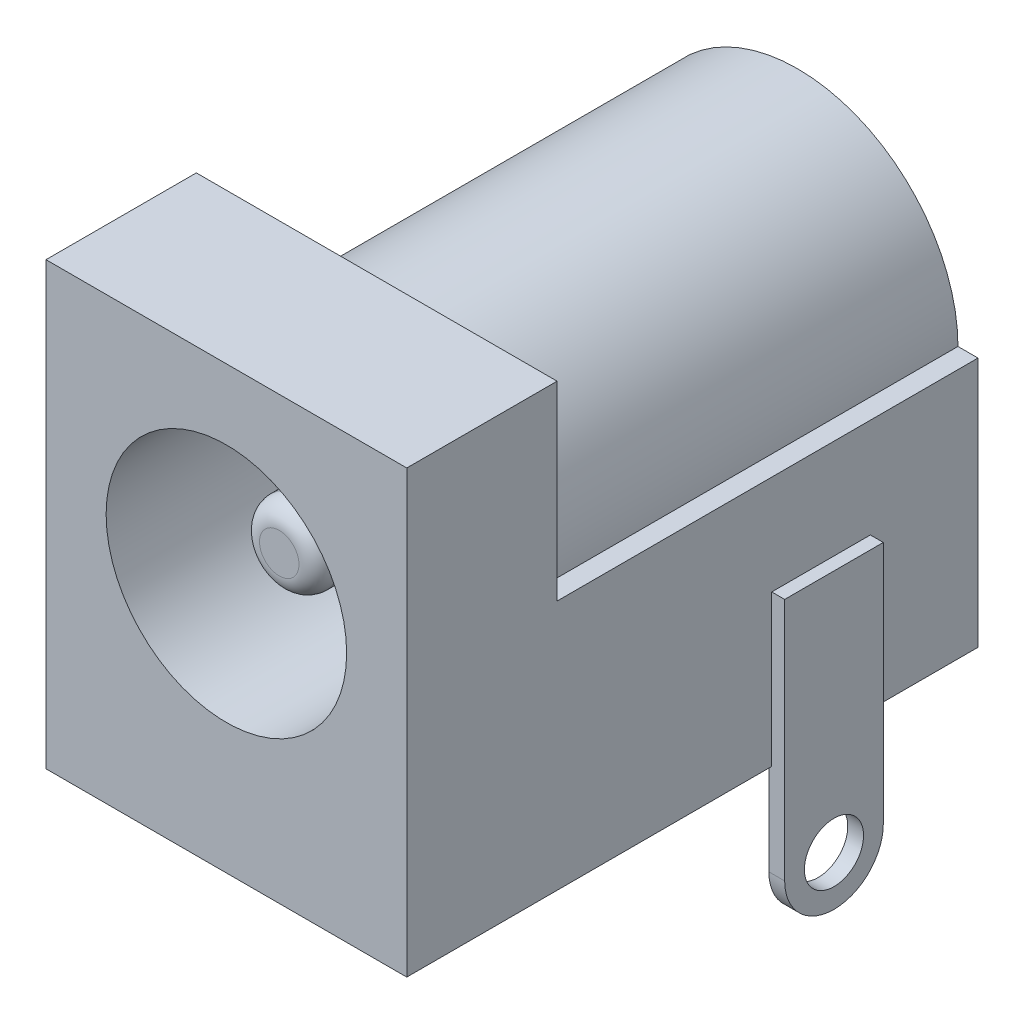
ISO-10303-21;
HEADER;
FILE_DESCRIPTION(('STEP AP214'),'2;1');
FILE_NAME('part.step','',(''),(''),'','','');
FILE_SCHEMA(('AUTOMOTIVE_DESIGN { 1 0 10303 214 1 1 1 1 }'));
ENDSEC;
DATA;
#1=APPLICATION_CONTEXT('core data for automotive mechanical design processes');
#2=APPLICATION_PROTOCOL_DEFINITION('international standard','automotive_design',2000,#1);
#3=PRODUCT_CONTEXT('',#1,'mechanical');
#4=PRODUCT('Part','Part','',(#3));
#5=PRODUCT_RELATED_PRODUCT_CATEGORY('part','',(#4));
#6=PRODUCT_DEFINITION_FORMATION('','',#4);
#7=PRODUCT_DEFINITION_CONTEXT('part definition',#1,'design');
#8=PRODUCT_DEFINITION('design','',#6,#7);
#9=PRODUCT_DEFINITION_SHAPE('','',#8);
#10=(LENGTH_UNIT() NAMED_UNIT(*) SI_UNIT(.MILLI.,.METRE.));
#11=(NAMED_UNIT(*) PLANE_ANGLE_UNIT() SI_UNIT($,.RADIAN.));
#12=(NAMED_UNIT(*) SI_UNIT($,.STERADIAN.) SOLID_ANGLE_UNIT());
#13=UNCERTAINTY_MEASURE_WITH_UNIT(LENGTH_MEASURE(1.E-05),#10,'distance_accuracy_value','');
#14=(GEOMETRIC_REPRESENTATION_CONTEXT(3) GLOBAL_UNCERTAINTY_ASSIGNED_CONTEXT((#13)) GLOBAL_UNIT_ASSIGNED_CONTEXT((#10,
#11,#12)) REPRESENTATION_CONTEXT('',''));
#15=CARTESIAN_POINT('',(0.,0.,0.));
#16=DIRECTION('',(0.,0.,1.));
#17=DIRECTION('',(1.,0.,0.));
#18=AXIS2_PLACEMENT_3D('',#15,#16,#17);
#19=CARTESIAN_POINT('',(-4.572,11.176,-1.34));
#20=DIRECTION('',(0.,0.,-1.));
#21=DIRECTION('',(-1.,0.,0.));
#22=AXIS2_PLACEMENT_3D('',#19,#20,#21);
#23=PLANE('',#22);
#24=CARTESIAN_POINT('',(0.,6.35,-1.34));
#25=DIRECTION('',(0.,0.,-1.));
#26=DIRECTION('',(-1.,0.,0.));
#27=AXIS2_PLACEMENT_3D('',#24,#25,#26);
#28=CIRCLE('',#27,0.499999999999998);
#29=CARTESIAN_POINT('',(-0.499999999999997,6.35,-1.34));
#30=VERTEX_POINT('',#29);
#31=EDGE_CURVE('E240',#30,#30,#28,.F.);
#32=ORIENTED_EDGE('',*,*,#31,.T.);
#33=EDGE_LOOP('',(#32));
#34=FACE_BOUND('',#33,.T.);
#35=ADVANCED_FACE('F17',(#34),#23,.F.);
#36=CARTESIAN_POINT('',(4.9,-2.35000000000015,-10.4999999999999));
#37=DIRECTION('',(-1.,0.,0.));
#38=DIRECTION('',(0.,0.,1.));
#39=AXIS2_PLACEMENT_3D('',#36,#37,#38);
#40=PLANE('',#39);
#41=CARTESIAN_POINT('',(4.9,-2.35000000000015,-10.4999999999999));
#42=DIRECTION('',(-1.,0.,0.));
#43=DIRECTION('',(0.,0.,1.));
#44=AXIS2_PLACEMENT_3D('',#41,#42,#43);
#45=CIRCLE('',#44,0.750000000000001);
#46=CARTESIAN_POINT('',(4.9,-2.35000000000015,-9.7499999999999));
#47=VERTEX_POINT('',#46);
#48=EDGE_CURVE('E173',#47,#47,#45,.T.);
#49=ORIENTED_EDGE('',*,*,#48,.T.);
#50=EDGE_LOOP('',(#49));
#51=FACE_BOUND('',#50,.T.);
#52=DIRECTION('',(0.,1.,0.));
#53=VECTOR('',#52,1.);
#54=CARTESIAN_POINT('',(4.9,3.8299999999999,-9.2499999999999));
#55=LINE('',#54,#53);
#56=CARTESIAN_POINT('',(4.9,3.8299999999999,-9.2499999999999));
#57=VERTEX_POINT('',#56);
#58=CARTESIAN_POINT('',(4.9,-2.35000000000015,-9.2499999999999));
#59=VERTEX_POINT('',#58);
#60=EDGE_CURVE('E169',#57,#59,#55,.F.);
#61=ORIENTED_EDGE('',*,*,#60,.T.);
#62=CARTESIAN_POINT('',(4.9,-2.35000000000015,-10.4999999999999));
#63=DIRECTION('',(-1.,0.,0.));
#64=DIRECTION('',(0.,0.,1.));
#65=AXIS2_PLACEMENT_3D('',#62,#63,#64);
#66=CIRCLE('',#65,1.25);
#67=CARTESIAN_POINT('',(4.9,-2.35000000000015,-11.7499999999999));
#68=VERTEX_POINT('',#67);
#69=EDGE_CURVE('E21',#68,#59,#66,.T.);
#70=ORIENTED_EDGE('',*,*,#69,.F.);
#71=DIRECTION('',(0.,1.,0.));
#72=VECTOR('',#71,1.);
#73=CARTESIAN_POINT('',(4.9,3.8299999999999,-11.7499999999999));
#74=LINE('',#73,#72);
#75=CARTESIAN_POINT('',(4.9,3.8299999999999,-11.7499999999999));
#76=VERTEX_POINT('',#75);
#77=EDGE_CURVE('E168',#68,#76,#74,.T.);
#78=ORIENTED_EDGE('',*,*,#77,.T.);
#79=DIRECTION('',(0.,0.,-1.));
#80=VECTOR('',#79,1.);
#81=CARTESIAN_POINT('',(4.9,3.8299999999999,-9.2499999999999));
#82=LINE('',#81,#80);
#83=EDGE_CURVE('E209',#76,#57,#82,.F.);
#84=ORIENTED_EDGE('',*,*,#83,.T.);
#85=EDGE_LOOP('',(#61,#70,#78,#84));
#86=FACE_BOUND('',#85,.T.);
#87=ADVANCED_FACE('F166',(#51,#86),#40,.F.);
#88=CARTESIAN_POINT('',(4.9,-2.35000000000015,-10.4999999999999));
#89=DIRECTION('',(-1.,0.,0.));
#90=DIRECTION('',(0.,0.,1.));
#91=AXIS2_PLACEMENT_3D('',#88,#89,#90);
#92=CYLINDRICAL_SURFACE('',#91,1.25);
#93=ORIENTED_EDGE('',*,*,#69,.T.);
#94=DIRECTION('',(1.,0.,0.));
#95=VECTOR('',#94,1.);
#96=CARTESIAN_POINT('',(4.9,-2.35000000000015,-9.2499999999999));
#97=LINE('',#96,#95);
#98=CARTESIAN_POINT('',(4.5,-2.35000000000015,-9.2499999999999));
#99=VERTEX_POINT('',#98);
#100=EDGE_CURVE('E205',#59,#99,#97,.F.);
#101=ORIENTED_EDGE('',*,*,#100,.T.);
#102=CARTESIAN_POINT('',(4.5,-2.35000000000015,-10.4999999999999));
#103=DIRECTION('',(-1.,0.,0.));
#104=DIRECTION('',(0.,0.,1.));
#105=AXIS2_PLACEMENT_3D('',#102,#103,#104);
#106=CIRCLE('',#105,1.25);
#107=CARTESIAN_POINT('',(4.5,-2.35000000000015,-11.7499999999999));
#108=VERTEX_POINT('',#107);
#109=EDGE_CURVE('E187',#108,#99,#106,.T.);
#110=ORIENTED_EDGE('',*,*,#109,.F.);
#111=DIRECTION('',(1.,0.,0.));
#112=VECTOR('',#111,1.);
#113=CARTESIAN_POINT('',(4.9,-2.35000000000015,-11.7499999999999));
#114=LINE('',#113,#112);
#115=EDGE_CURVE('E178',#108,#68,#114,.T.);
#116=ORIENTED_EDGE('',*,*,#115,.T.);
#117=EDGE_LOOP('',(#93,#101,#110,#116));
#118=FACE_BOUND('',#117,.T.);
#119=ADVANCED_FACE('F185',(#118),#92,.T.);
#120=CARTESIAN_POINT('',(4.9,-2.35000000000015,-10.4999999999999));
#121=DIRECTION('',(-1.,0.,0.));
#122=DIRECTION('',(0.,0.,1.));
#123=AXIS2_PLACEMENT_3D('',#120,#121,#122);
#124=CYLINDRICAL_SURFACE('',#123,0.750000000000001);
#125=CARTESIAN_POINT('',(4.5,-2.35000000000015,-10.4999999999999));
#126=DIRECTION('',(-1.,0.,0.));
#127=DIRECTION('',(0.,0.,1.));
#128=AXIS2_PLACEMENT_3D('',#125,#126,#127);
#129=CIRCLE('',#128,0.750000000000001);
#130=CARTESIAN_POINT('',(4.5,-2.35000000000015,-9.7499999999999));
#131=VERTEX_POINT('',#130);
#132=EDGE_CURVE('E297',#131,#131,#129,.F.);
#133=ORIENTED_EDGE('',*,*,#132,.F.);
#134=EDGE_LOOP('',(#133));
#135=FACE_BOUND('',#134,.T.);
#136=ORIENTED_EDGE('',*,*,#48,.F.);
#137=EDGE_LOOP('',(#136));
#138=FACE_BOUND('',#137,.T.);
#139=ADVANCED_FACE('F607',(#135,#138),#124,.F.);
#140=CARTESIAN_POINT('',(1.425,0.,-13.5));
#141=DIRECTION('',(-1.,0.,0.));
#142=DIRECTION('',(0.,0.,1.));
#143=AXIS2_PLACEMENT_3D('',#140,#141,#142);
#144=PLANE('',#143);
#145=DIRECTION('',(0.,0.,1.));
#146=VECTOR('',#145,1.);
#147=CARTESIAN_POINT('',(1.425,0.,-13.5));
#148=LINE('',#147,#146);
#149=CARTESIAN_POINT('',(1.425,0.,-13.5));
#150=VERTEX_POINT('',#149);
#151=CARTESIAN_POINT('',(1.425,0.,-13.9));
#152=VERTEX_POINT('',#151);
#153=EDGE_CURVE('E305',#150,#152,#148,.F.);
#154=ORIENTED_EDGE('',*,*,#153,.F.);
#155=DIRECTION('',(0.,1.,0.));
#156=VECTOR('',#155,1.);
#157=CARTESIAN_POINT('',(1.425,-2.175,-13.5));
#158=LINE('',#157,#156);
#159=CARTESIAN_POINT('',(1.425,-2.175,-13.5));
#160=VERTEX_POINT('',#159);
#161=EDGE_CURVE('E289',#150,#160,#158,.F.);
#162=ORIENTED_EDGE('',*,*,#161,.T.);
#163=DIRECTION('',(0.,0.,-1.));
#164=VECTOR('',#163,1.);
#165=CARTESIAN_POINT('',(1.425,-2.175,-13.5));
#166=LINE('',#165,#164);
#167=CARTESIAN_POINT('',(1.425,-2.175,-13.9));
#168=VERTEX_POINT('',#167);
#169=EDGE_CURVE('E308',#168,#160,#166,.F.);
#170=ORIENTED_EDGE('',*,*,#169,.F.);
#171=DIRECTION('',(0.,1.,0.));
#172=VECTOR('',#171,1.);
#173=CARTESIAN_POINT('',(1.425,-2.175,-13.9));
#174=LINE('',#173,#172);
#175=EDGE_CURVE('E296',#152,#168,#174,.F.);
#176=ORIENTED_EDGE('',*,*,#175,.F.);
#177=EDGE_LOOP('',(#154,#162,#170,#176));
#178=FACE_BOUND('',#177,.T.);
#179=ADVANCED_FACE('F603',(#178),#144,.F.);
#180=CARTESIAN_POINT('',(0.,-2.175,-13.5));
#181=DIRECTION('',(0.,0.,-1.));
#182=DIRECTION('',(-1.,0.,0.));
#183=AXIS2_PLACEMENT_3D('',#180,#181,#182);
#184=CYLINDRICAL_SURFACE('',#183,1.425);
#185=CARTESIAN_POINT('',(0.,-2.175,-13.5));
#186=DIRECTION('',(0.,0.,-1.));
#187=DIRECTION('',(-1.,0.,0.));
#188=AXIS2_PLACEMENT_3D('',#185,#186,#187);
#189=CIRCLE('',#188,1.425);
#190=CARTESIAN_POINT('',(-1.425,-2.175,-13.5));
#191=VERTEX_POINT('',#190);
#192=EDGE_CURVE('E286',#160,#191,#189,.T.);
#193=ORIENTED_EDGE('',*,*,#192,.T.);
#194=DIRECTION('',(0.,0.,1.));
#195=VECTOR('',#194,1.);
#196=CARTESIAN_POINT('',(-1.425,-2.175,-13.5));
#197=LINE('',#196,#195);
#198=CARTESIAN_POINT('',(-1.425,-2.175,-13.9));
#199=VERTEX_POINT('',#198);
#200=EDGE_CURVE('E332',#191,#199,#197,.F.);
#201=ORIENTED_EDGE('',*,*,#200,.T.);
#202=CARTESIAN_POINT('',(0.,-2.175,-13.9));
#203=DIRECTION('',(0.,0.,-1.));
#204=DIRECTION('',(-1.,0.,0.));
#205=AXIS2_PLACEMENT_3D('',#202,#203,#204);
#206=CIRCLE('',#205,1.425);
#207=EDGE_CURVE('E294',#168,#199,#206,.T.);
#208=ORIENTED_EDGE('',*,*,#207,.F.);
#209=ORIENTED_EDGE('',*,*,#169,.T.);
#210=EDGE_LOOP('',(#193,#201,#208,#209));
#211=FACE_BOUND('',#210,.T.);
#212=ADVANCED_FACE('F599',(#211),#184,.T.);
#213=CARTESIAN_POINT('',(-1.425,0.,-13.5));
#214=DIRECTION('',(1.,0.,0.));
#215=DIRECTION('',(0.,1.,0.));
#216=AXIS2_PLACEMENT_3D('',#213,#214,#215);
#217=PLANE('',#216);
#218=ORIENTED_EDGE('',*,*,#200,.F.);
#219=DIRECTION('',(0.,1.,0.));
#220=VECTOR('',#219,1.);
#221=CARTESIAN_POINT('',(-1.425,-2.175,-13.5));
#222=LINE('',#221,#220);
#223=CARTESIAN_POINT('',(-1.425,0.,-13.5));
#224=VERTEX_POINT('',#223);
#225=EDGE_CURVE('E285',#191,#224,#222,.T.);
#226=ORIENTED_EDGE('',*,*,#225,.T.);
#227=DIRECTION('',(0.,0.,1.));
#228=VECTOR('',#227,1.);
#229=CARTESIAN_POINT('',(-1.425,0.,-13.5));
#230=LINE('',#229,#228);
#231=CARTESIAN_POINT('',(-1.425,0.,-13.9));
#232=VERTEX_POINT('',#231);
#233=EDGE_CURVE('E314',#232,#224,#230,.T.);
#234=ORIENTED_EDGE('',*,*,#233,.F.);
#235=DIRECTION('',(0.,1.,0.));
#236=VECTOR('',#235,1.);
#237=CARTESIAN_POINT('',(-1.425,-2.175,-13.9));
#238=LINE('',#237,#236);
#239=EDGE_CURVE('E293',#199,#232,#238,.T.);
#240=ORIENTED_EDGE('',*,*,#239,.F.);
#241=EDGE_LOOP('',(#218,#226,#234,#240));
#242=FACE_BOUND('',#241,.T.);
#243=ADVANCED_FACE('F595',(#242),#217,.F.);
#244=CARTESIAN_POINT('',(0.,-2.175,-13.5));
#245=DIRECTION('',(0.,0.,-1.));
#246=DIRECTION('',(-1.,0.,0.));
#247=AXIS2_PLACEMENT_3D('',#244,#245,#246);
#248=CYLINDRICAL_SURFACE('',#247,0.749999999999955);
#249=CARTESIAN_POINT('',(0.,-2.175,-13.9));
#250=DIRECTION('',(0.,0.,-1.));
#251=DIRECTION('',(-1.,0.,0.));
#252=AXIS2_PLACEMENT_3D('',#249,#250,#251);
#253=CIRCLE('',#252,0.749999999999955);
#254=CARTESIAN_POINT('',(-0.749999999999955,-2.175,-13.9));
#255=VERTEX_POINT('',#254);
#256=EDGE_CURVE('E290',#255,#255,#253,.F.);
#257=ORIENTED_EDGE('',*,*,#256,.F.);
#258=EDGE_LOOP('',(#257));
#259=FACE_BOUND('',#258,.T.);
#260=CARTESIAN_POINT('',(0.,-2.175,-13.5));
#261=DIRECTION('',(0.,0.,-1.));
#262=DIRECTION('',(-1.,0.,0.));
#263=AXIS2_PLACEMENT_3D('',#260,#261,#262);
#264=CIRCLE('',#263,0.749999999999955);
#265=CARTESIAN_POINT('',(-0.749999999999955,-2.175,-13.5));
#266=VERTEX_POINT('',#265);
#267=EDGE_CURVE('E282',#266,#266,#264,.F.);
#268=ORIENTED_EDGE('',*,*,#267,.T.);
#269=EDGE_LOOP('',(#268));
#270=FACE_BOUND('',#269,.T.);
#271=ADVANCED_FACE('F591',(#259,#270),#248,.F.);
#272=CARTESIAN_POINT('',(-1.1,0.,-7.35));
#273=DIRECTION('',(1.,0.,0.));
#274=DIRECTION('',(0.,1.,0.));
#275=AXIS2_PLACEMENT_3D('',#272,#273,#274);
#276=PLANE('',#275);
#277=DIRECTION('',(0.,0.,-1.));
#278=VECTOR('',#277,1.);
#279=CARTESIAN_POINT('',(-1.1,-2.5,-7.35));
#280=LINE('',#279,#278);
#281=CARTESIAN_POINT('',(-1.1,-2.5,-7.35));
#282=VERTEX_POINT('',#281);
#283=CARTESIAN_POINT('',(-1.1,-2.5,-7.65));
#284=VERTEX_POINT('',#283);
#285=EDGE_CURVE('E341',#282,#284,#280,.T.);
#286=ORIENTED_EDGE('',*,*,#285,.F.);
#287=DIRECTION('',(0.,1.,0.));
#288=VECTOR('',#287,1.);
#289=CARTESIAN_POINT('',(-1.1,-2.5,-7.35));
#290=LINE('',#289,#288);
#291=CARTESIAN_POINT('',(-1.1,0.,-7.35));
#292=VERTEX_POINT('',#291);
#293=EDGE_CURVE('E273',#292,#282,#290,.F.);
#294=ORIENTED_EDGE('',*,*,#293,.F.);
#295=DIRECTION('',(0.,0.,1.));
#296=VECTOR('',#295,1.);
#297=CARTESIAN_POINT('',(-1.1,0.,-7.35));
#298=LINE('',#297,#296);
#299=CARTESIAN_POINT('',(-1.1,0.,-7.65));
#300=VERTEX_POINT('',#299);
#301=EDGE_CURVE('E335',#300,#292,#298,.T.);
#302=ORIENTED_EDGE('',*,*,#301,.F.);
#303=DIRECTION('',(0.,1.,0.));
#304=VECTOR('',#303,1.);
#305=CARTESIAN_POINT('',(-1.1,-2.5,-7.65));
#306=LINE('',#305,#304);
#307=EDGE_CURVE('E281',#300,#284,#306,.F.);
#308=ORIENTED_EDGE('',*,*,#307,.T.);
#309=EDGE_LOOP('',(#286,#294,#302,#308));
#310=FACE_BOUND('',#309,.T.);
#311=ADVANCED_FACE('F587',(#310),#276,.F.);
#312=CARTESIAN_POINT('',(0.,-2.5,-7.35));
#313=DIRECTION('',(0.,0.,-1.));
#314=DIRECTION('',(-1.,0.,0.));
#315=AXIS2_PLACEMENT_3D('',#312,#313,#314);
#316=CYLINDRICAL_SURFACE('',#315,1.1);
#317=CARTESIAN_POINT('',(0.,-2.5,-7.35));
#318=DIRECTION('',(0.,0.,-1.));
#319=DIRECTION('',(-1.,0.,0.));
#320=AXIS2_PLACEMENT_3D('',#317,#318,#319);
#321=CIRCLE('',#320,1.1);
#322=CARTESIAN_POINT('',(1.1,-2.5,-7.35));
#323=VERTEX_POINT('',#322);
#324=EDGE_CURVE('E271',#282,#323,#321,.F.);
#325=ORIENTED_EDGE('',*,*,#324,.F.);
#326=ORIENTED_EDGE('',*,*,#285,.T.);
#327=CARTESIAN_POINT('',(0.,-2.5,-7.65));
#328=DIRECTION('',(0.,0.,-1.));
#329=DIRECTION('',(-1.,0.,0.));
#330=AXIS2_PLACEMENT_3D('',#327,#328,#329);
#331=CIRCLE('',#330,1.1);
#332=CARTESIAN_POINT('',(1.1,-2.5,-7.65));
#333=VERTEX_POINT('',#332);
#334=EDGE_CURVE('E278',#284,#333,#331,.F.);
#335=ORIENTED_EDGE('',*,*,#334,.T.);
#336=DIRECTION('',(0.,0.,1.));
#337=VECTOR('',#336,1.);
#338=CARTESIAN_POINT('',(1.1,-2.5,-7.35));
#339=LINE('',#338,#337);
#340=EDGE_CURVE('E343',#333,#323,#339,.T.);
#341=ORIENTED_EDGE('',*,*,#340,.T.);
#342=EDGE_LOOP('',(#325,#326,#335,#341));
#343=FACE_BOUND('',#342,.T.);
#344=ADVANCED_FACE('F583',(#343),#316,.T.);
#345=CARTESIAN_POINT('',(1.1,0.,-7.35));
#346=DIRECTION('',(-1.,0.,0.));
#347=DIRECTION('',(0.,-1.,0.));
#348=AXIS2_PLACEMENT_3D('',#345,#346,#347);
#349=PLANE('',#348);
#350=DIRECTION('',(0.,0.,1.));
#351=VECTOR('',#350,1.);
#352=CARTESIAN_POINT('',(1.1,0.,-7.35));
#353=LINE('',#352,#351);
#354=CARTESIAN_POINT('',(1.1,0.,-7.35));
#355=VERTEX_POINT('',#354);
#356=CARTESIAN_POINT('',(1.1,0.,-7.65));
#357=VERTEX_POINT('',#356);
#358=EDGE_CURVE('E303',#355,#357,#353,.F.);
#359=ORIENTED_EDGE('',*,*,#358,.F.);
#360=DIRECTION('',(0.,1.,0.));
#361=VECTOR('',#360,1.);
#362=CARTESIAN_POINT('',(1.1,-2.5,-7.35));
#363=LINE('',#362,#361);
#364=EDGE_CURVE('E270',#323,#355,#363,.T.);
#365=ORIENTED_EDGE('',*,*,#364,.F.);
#366=ORIENTED_EDGE('',*,*,#340,.F.);
#367=DIRECTION('',(0.,1.,0.));
#368=VECTOR('',#367,1.);
#369=CARTESIAN_POINT('',(1.1,-2.5,-7.65));
#370=LINE('',#369,#368);
#371=EDGE_CURVE('E277',#333,#357,#370,.T.);
#372=ORIENTED_EDGE('',*,*,#371,.T.);
#373=EDGE_LOOP('',(#359,#365,#366,#372));
#374=FACE_BOUND('',#373,.T.);
#375=ADVANCED_FACE('F577',(#374),#349,.F.);
#376=CARTESIAN_POINT('',(0.,-2.5,-7.35));
#377=DIRECTION('',(0.,0.,-1.));
#378=DIRECTION('',(-1.,0.,0.));
#379=AXIS2_PLACEMENT_3D('',#376,#377,#378);
#380=CYLINDRICAL_SURFACE('',#379,0.75);
#381=CARTESIAN_POINT('',(0.,-2.5,-7.65));
#382=DIRECTION('',(0.,0.,-1.));
#383=DIRECTION('',(-1.,0.,0.));
#384=AXIS2_PLACEMENT_3D('',#381,#382,#383);
#385=CIRCLE('',#384,0.75);
#386=CARTESIAN_POINT('',(-0.75,-2.5,-7.65));
#387=VERTEX_POINT('',#386);
#388=EDGE_CURVE('E274',#387,#387,#385,.T.);
#389=ORIENTED_EDGE('',*,*,#388,.T.);
#390=EDGE_LOOP('',(#389));
#391=FACE_BOUND('',#390,.T.);
#392=CARTESIAN_POINT('',(0.,-2.5,-7.35));
#393=DIRECTION('',(0.,0.,-1.));
#394=DIRECTION('',(-1.,0.,0.));
#395=AXIS2_PLACEMENT_3D('',#392,#393,#394);
#396=CIRCLE('',#395,0.75);
#397=CARTESIAN_POINT('',(-0.75,-2.5,-7.35));
#398=VERTEX_POINT('',#397);
#399=EDGE_CURVE('E267',#398,#398,#396,.T.);
#400=ORIENTED_EDGE('',*,*,#399,.F.);
#401=EDGE_LOOP('',(#400));
#402=FACE_BOUND('',#401,.T.);
#403=ADVANCED_FACE('F570',(#391,#402),#380,.F.);
#404=CARTESIAN_POINT('',(0.,6.35,-14.478));
#405=DIRECTION('',(0.,0.,1.));
#406=DIRECTION('',(1.,0.,0.));
#407=AXIS2_PLACEMENT_3D('',#404,#405,#406);
#408=CYLINDRICAL_SURFACE('',#407,4.064);
#409=CARTESIAN_POINT('',(0.,6.35,-14.478));
#410=DIRECTION('',(0.,0.,1.));
#411=DIRECTION('',(1.,0.,0.));
#412=AXIS2_PLACEMENT_3D('',#409,#410,#411);
#413=CIRCLE('',#412,4.064);
#414=CARTESIAN_POINT('',(4.064,6.34999999999999,-14.478));
#415=VERTEX_POINT('',#414);
#416=CARTESIAN_POINT('',(-4.064,6.35,-14.478));
#417=VERTEX_POINT('',#416);
#418=EDGE_CURVE('E258',#415,#417,#413,.T.);
#419=ORIENTED_EDGE('',*,*,#418,.T.);
#420=DIRECTION('',(0.,0.,1.));
#421=VECTOR('',#420,1.);
#422=CARTESIAN_POINT('',(-4.064,6.35,-14.478));
#423=LINE('',#422,#421);
#424=CARTESIAN_POINT('',(-4.064,6.35,-3.81));
#425=VERTEX_POINT('',#424);
#426=EDGE_CURVE('E265',#417,#425,#423,.T.);
#427=ORIENTED_EDGE('',*,*,#426,.T.);
#428=CARTESIAN_POINT('',(0.,6.35,-3.81));
#429=DIRECTION('',(0.,0.,1.));
#430=DIRECTION('',(1.,0.,0.));
#431=AXIS2_PLACEMENT_3D('',#428,#429,#430);
#432=CIRCLE('',#431,4.064);
#433=CARTESIAN_POINT('',(4.064,6.34999999999999,-3.81));
#434=VERTEX_POINT('',#433);
#435=EDGE_CURVE('E263',#434,#425,#432,.T.);
#436=ORIENTED_EDGE('',*,*,#435,.F.);
#437=DIRECTION('',(0.,0.,1.));
#438=VECTOR('',#437,1.);
#439=CARTESIAN_POINT('',(4.064,6.35,-14.478));
#440=LINE('',#439,#438);
#441=EDGE_CURVE('E215',#434,#415,#440,.F.);
#442=ORIENTED_EDGE('',*,*,#441,.T.);
#443=EDGE_LOOP('',(#419,#427,#436,#442));
#444=FACE_BOUND('',#443,.T.);
#445=ADVANCED_FACE('F568',(#444),#408,.T.);
#446=CARTESIAN_POINT('',(0.,6.35,-1.84));
#447=DIRECTION('',(0.,0.,-1.));
#448=DIRECTION('',(-1.,0.,0.));
#449=AXIS2_PLACEMENT_3D('',#446,#447,#448);
#450=DEGENERATE_TOROIDAL_SURFACE('',#449,0.499999999999998,0.5,.T.);
#451=ORIENTED_EDGE('',*,*,#31,.F.);
#452=EDGE_LOOP('',(#451));
#453=FACE_BOUND('',#452,.T.);
#454=CARTESIAN_POINT('',(0.,6.35,-1.84));
#455=DIRECTION('',(0.,0.,-1.));
#456=DIRECTION('',(-1.,0.,0.));
#457=AXIS2_PLACEMENT_3D('',#454,#455,#456);
#458=CIRCLE('',#457,0.999999999999999);
#459=CARTESIAN_POINT('',(-0.999999999999999,6.35,-1.84));
#460=VERTEX_POINT('',#459);
#461=EDGE_CURVE('E261',#460,#460,#458,.T.);
#462=ORIENTED_EDGE('',*,*,#461,.F.);
#463=EDGE_LOOP('',(#462));
#464=FACE_BOUND('',#463,.T.);
#465=ADVANCED_FACE('F19',(#453,#464),#450,.T.);
#466=CARTESIAN_POINT('',(4.9,3.8299999999999,-9.2499999999999));
#467=DIRECTION('',(0.,0.,-1.));
#468=DIRECTION('',(0.,1.,0.));
#469=AXIS2_PLACEMENT_3D('',#466,#467,#468);
#470=PLANE('',#469);
#471=DIRECTION('',(1.,0.,0.));
#472=VECTOR('',#471,1.);
#473=CARTESIAN_POINT('',(4.9,0.,-9.2499999999999));
#474=LINE('',#473,#472);
#475=CARTESIAN_POINT('',(4.5,0.,-9.2499999999999));
#476=VERTEX_POINT('',#475);
#477=CARTESIAN_POINT('',(4.572,0.,-9.2499999999999));
#478=VERTEX_POINT('',#477);
#479=EDGE_CURVE('E207',#476,#478,#474,.T.);
#480=ORIENTED_EDGE('',*,*,#479,.F.);
#481=DIRECTION('',(0.,1.,0.));
#482=VECTOR('',#481,1.);
#483=CARTESIAN_POINT('',(4.5,-2.35000000000015,-9.2499999999999));
#484=LINE('',#483,#482);
#485=EDGE_CURVE('E387',#99,#476,#484,.T.);
#486=ORIENTED_EDGE('',*,*,#485,.F.);
#487=ORIENTED_EDGE('',*,*,#100,.F.);
#488=ORIENTED_EDGE('',*,*,#60,.F.);
#489=DIRECTION('',(1.,0.,0.));
#490=VECTOR('',#489,1.);
#491=CARTESIAN_POINT('',(4.9,3.8299999999999,-9.2499999999999));
#492=LINE('',#491,#490);
#493=CARTESIAN_POINT('',(4.572,3.8299999999999,-9.2499999999999));
#494=VERTEX_POINT('',#493);
#495=EDGE_CURVE('E190',#57,#494,#492,.F.);
#496=ORIENTED_EDGE('',*,*,#495,.T.);
#497=DIRECTION('',(0.,1.,0.));
#498=VECTOR('',#497,1.);
#499=CARTESIAN_POINT('',(4.572,0.,-9.2499999999999));
#500=LINE('',#499,#498);
#501=EDGE_CURVE('E243',#478,#494,#500,.T.);
#502=ORIENTED_EDGE('',*,*,#501,.F.);
#503=EDGE_LOOP('',(#480,#486,#487,#488,#496,#502));
#504=FACE_BOUND('',#503,.T.);
#505=ADVANCED_FACE('F493',(#504),#470,.F.);
#506=CARTESIAN_POINT('',(4.9,3.8299999999999,-9.2499999999999));
#507=DIRECTION('',(0.,-1.,0.));
#508=DIRECTION('',(0.,0.,-1.));
#509=AXIS2_PLACEMENT_3D('',#506,#507,#508);
#510=PLANE('',#509);
#511=ORIENTED_EDGE('',*,*,#495,.F.);
#512=ORIENTED_EDGE('',*,*,#83,.F.);
#513=DIRECTION('',(1.,0.,0.));
#514=VECTOR('',#513,1.);
#515=CARTESIAN_POINT('',(4.9,3.8299999999999,-11.7499999999999));
#516=LINE('',#515,#514);
#517=CARTESIAN_POINT('',(4.572,3.8299999999999,-11.7499999999999));
#518=VERTEX_POINT('',#517);
#519=EDGE_CURVE('E182',#76,#518,#516,.F.);
#520=ORIENTED_EDGE('',*,*,#519,.T.);
#521=DIRECTION('',(0.,0.,-1.));
#522=VECTOR('',#521,1.);
#523=CARTESIAN_POINT('',(4.572,3.8299999999999,-3.81));
#524=LINE('',#523,#522);
#525=EDGE_CURVE('E225',#494,#518,#524,.T.);
#526=ORIENTED_EDGE('',*,*,#525,.F.);
#527=EDGE_LOOP('',(#511,#512,#520,#526));
#528=FACE_BOUND('',#527,.T.);
#529=ADVANCED_FACE('F496',(#528),#510,.F.);
#530=CARTESIAN_POINT('',(4.9,3.8299999999999,-11.7499999999999));
#531=DIRECTION('',(0.,0.,1.));
#532=DIRECTION('',(1.,0.,0.));
#533=AXIS2_PLACEMENT_3D('',#530,#531,#532);
#534=PLANE('',#533);
#535=ORIENTED_EDGE('',*,*,#519,.F.);
#536=ORIENTED_EDGE('',*,*,#77,.F.);
#537=ORIENTED_EDGE('',*,*,#115,.F.);
#538=DIRECTION('',(0.,1.,0.));
#539=VECTOR('',#538,1.);
#540=CARTESIAN_POINT('',(4.5,-2.35000000000015,-11.7499999999999));
#541=LINE('',#540,#539);
#542=CARTESIAN_POINT('',(4.5,0.,-11.7499999999999));
#543=VERTEX_POINT('',#542);
#544=EDGE_CURVE('E301',#543,#108,#541,.F.);
#545=ORIENTED_EDGE('',*,*,#544,.F.);
#546=DIRECTION('',(1.,0.,0.));
#547=VECTOR('',#546,1.);
#548=CARTESIAN_POINT('',(4.9,0.,-11.7499999999999));
#549=LINE('',#548,#547);
#550=CARTESIAN_POINT('',(4.572,0.,-11.7499999999999));
#551=VERTEX_POINT('',#550);
#552=EDGE_CURVE('E188',#551,#543,#549,.F.);
#553=ORIENTED_EDGE('',*,*,#552,.F.);
#554=DIRECTION('',(0.,1.,0.));
#555=VECTOR('',#554,1.);
#556=CARTESIAN_POINT('',(4.572,0.,-11.7499999999999));
#557=LINE('',#556,#555);
#558=EDGE_CURVE('E221',#518,#551,#557,.F.);
#559=ORIENTED_EDGE('',*,*,#558,.F.);
#560=EDGE_LOOP('',(#535,#536,#537,#545,#553,#559));
#561=FACE_BOUND('',#560,.T.);
#562=ADVANCED_FACE('F176',(#561),#534,.F.);
#563=CARTESIAN_POINT('',(4.064,6.35,-14.478));
#564=DIRECTION('',(0.,-1.,0.));
#565=DIRECTION('',(1.,0.,0.));
#566=AXIS2_PLACEMENT_3D('',#563,#564,#565);
#567=PLANE('',#566);
#568=DIRECTION('',(0.,0.,-1.));
#569=VECTOR('',#568,1.);
#570=CARTESIAN_POINT('',(4.572,6.34999999999998,-3.81));
#571=LINE('',#570,#569);
#572=CARTESIAN_POINT('',(4.572,6.34999999999998,-14.478));
#573=VERTEX_POINT('',#572);
#574=CARTESIAN_POINT('',(4.572,6.34999999999998,-3.81));
#575=VERTEX_POINT('',#574);
#576=EDGE_CURVE('E358',#573,#575,#571,.F.);
#577=ORIENTED_EDGE('',*,*,#576,.F.);
#578=DIRECTION('',(1.,0.,0.));
#579=VECTOR('',#578,1.);
#580=CARTESIAN_POINT('',(0.,6.34999999999998,-14.478));
#581=LINE('',#580,#579);
#582=EDGE_CURVE('E262',#573,#415,#581,.F.);
#583=ORIENTED_EDGE('',*,*,#582,.T.);
#584=ORIENTED_EDGE('',*,*,#441,.F.);
#585=DIRECTION('',(-1.,0.,0.));
#586=VECTOR('',#585,1.);
#587=CARTESIAN_POINT('',(-4.572,6.34999999999998,-3.81));
#588=LINE('',#587,#586);
#589=EDGE_CURVE('E266',#575,#434,#588,.T.);
#590=ORIENTED_EDGE('',*,*,#589,.F.);
#591=EDGE_LOOP('',(#577,#583,#584,#590));
#592=FACE_BOUND('',#591,.T.);
#593=ADVANCED_FACE('F504',(#592),#567,.F.);
#594=CARTESIAN_POINT('',(4.5,-2.35000000000015,-10.4999999999999));
#595=DIRECTION('',(-1.,0.,0.));
#596=DIRECTION('',(0.,0.,1.));
#597=AXIS2_PLACEMENT_3D('',#594,#595,#596);
#598=PLANE('',#597);
#599=ORIENTED_EDGE('',*,*,#132,.T.);
#600=EDGE_LOOP('',(#599));
#601=FACE_BOUND('',#600,.T.);
#602=ORIENTED_EDGE('',*,*,#544,.T.);
#603=ORIENTED_EDGE('',*,*,#109,.T.);
#604=ORIENTED_EDGE('',*,*,#485,.T.);
#605=DIRECTION('',(0.,0.,1.));
#606=VECTOR('',#605,1.);
#607=CARTESIAN_POINT('',(4.5,0.,-3.81));
#608=LINE('',#607,#606);
#609=EDGE_CURVE('E198',#543,#476,#608,.T.);
#610=ORIENTED_EDGE('',*,*,#609,.F.);
#611=EDGE_LOOP('',(#602,#603,#604,#610));
#612=FACE_BOUND('',#611,.T.);
#613=ADVANCED_FACE('F490',(#601,#612),#598,.T.);
#614=CARTESIAN_POINT('',(0.,-2.175,-13.9));
#615=DIRECTION('',(0.,0.,-1.));
#616=DIRECTION('',(-1.,0.,0.));
#617=AXIS2_PLACEMENT_3D('',#614,#615,#616);
#618=PLANE('',#617);
#619=ORIENTED_EDGE('',*,*,#256,.T.);
#620=EDGE_LOOP('',(#619));
#621=FACE_BOUND('',#620,.T.);
#622=ORIENTED_EDGE('',*,*,#207,.T.);
#623=ORIENTED_EDGE('',*,*,#239,.T.);
#624=DIRECTION('',(1.,0.,0.));
#625=VECTOR('',#624,1.);
#626=CARTESIAN_POINT('',(-4.572,0.,-13.9));
#627=LINE('',#626,#625);
#628=EDGE_CURVE('E231',#152,#232,#627,.F.);
#629=ORIENTED_EDGE('',*,*,#628,.F.);
#630=ORIENTED_EDGE('',*,*,#175,.T.);
#631=EDGE_LOOP('',(#622,#623,#629,#630));
#632=FACE_BOUND('',#631,.T.);
#633=ADVANCED_FACE('F553',(#621,#632),#618,.T.);
#634=CARTESIAN_POINT('',(0.,-2.175,-13.5));
#635=DIRECTION('',(0.,0.,-1.));
#636=DIRECTION('',(-1.,0.,0.));
#637=AXIS2_PLACEMENT_3D('',#634,#635,#636);
#638=PLANE('',#637);
#639=ORIENTED_EDGE('',*,*,#267,.F.);
#640=EDGE_LOOP('',(#639));
#641=FACE_BOUND('',#640,.T.);
#642=ORIENTED_EDGE('',*,*,#225,.F.);
#643=ORIENTED_EDGE('',*,*,#192,.F.);
#644=ORIENTED_EDGE('',*,*,#161,.F.);
#645=DIRECTION('',(1.,0.,0.));
#646=VECTOR('',#645,1.);
#647=CARTESIAN_POINT('',(-4.572,0.,-13.5));
#648=LINE('',#647,#646);
#649=EDGE_CURVE('E319',#224,#150,#648,.T.);
#650=ORIENTED_EDGE('',*,*,#649,.F.);
#651=EDGE_LOOP('',(#642,#643,#644,#650));
#652=FACE_BOUND('',#651,.T.);
#653=ADVANCED_FACE('F549',(#641,#652),#638,.F.);
#654=CARTESIAN_POINT('',(0.,-2.5,-7.65));
#655=DIRECTION('',(0.,0.,1.));
#656=DIRECTION('',(1.,0.,0.));
#657=AXIS2_PLACEMENT_3D('',#654,#655,#656);
#658=PLANE('',#657);
#659=ORIENTED_EDGE('',*,*,#388,.F.);
#660=EDGE_LOOP('',(#659));
#661=FACE_BOUND('',#660,.T.);
#662=ORIENTED_EDGE('',*,*,#371,.F.);
#663=ORIENTED_EDGE('',*,*,#334,.F.);
#664=ORIENTED_EDGE('',*,*,#307,.F.);
#665=DIRECTION('',(1.,0.,0.));
#666=VECTOR('',#665,1.);
#667=CARTESIAN_POINT('',(-4.572,0.,-7.65));
#668=LINE('',#667,#666);
#669=EDGE_CURVE('E321',#357,#300,#668,.F.);
#670=ORIENTED_EDGE('',*,*,#669,.F.);
#671=EDGE_LOOP('',(#662,#663,#664,#670));
#672=FACE_BOUND('',#671,.T.);
#673=ADVANCED_FACE('F545',(#661,#672),#658,.F.);
#674=CARTESIAN_POINT('',(0.,-2.5,-7.35));
#675=DIRECTION('',(0.,0.,1.));
#676=DIRECTION('',(1.,0.,0.));
#677=AXIS2_PLACEMENT_3D('',#674,#675,#676);
#678=PLANE('',#677);
#679=ORIENTED_EDGE('',*,*,#399,.T.);
#680=EDGE_LOOP('',(#679));
#681=FACE_BOUND('',#680,.T.);
#682=ORIENTED_EDGE('',*,*,#324,.T.);
#683=ORIENTED_EDGE('',*,*,#364,.T.);
#684=DIRECTION('',(1.,0.,0.));
#685=VECTOR('',#684,1.);
#686=CARTESIAN_POINT('',(-4.572,0.,-7.35));
#687=LINE('',#686,#685);
#688=EDGE_CURVE('E325',#292,#355,#687,.T.);
#689=ORIENTED_EDGE('',*,*,#688,.F.);
#690=ORIENTED_EDGE('',*,*,#293,.T.);
#691=EDGE_LOOP('',(#682,#683,#689,#690));
#692=FACE_BOUND('',#691,.T.);
#693=ADVANCED_FACE('F542',(#681,#692),#678,.T.);
#694=CARTESIAN_POINT('',(-4.572,11.176,-3.81));
#695=DIRECTION('',(0.,0.,-1.));
#696=DIRECTION('',(-1.,0.,0.));
#697=AXIS2_PLACEMENT_3D('',#694,#695,#696);
#698=PLANE('',#697);
#699=ORIENTED_EDGE('',*,*,#589,.T.);
#700=ORIENTED_EDGE('',*,*,#435,.T.);
#701=DIRECTION('',(1.,0.,0.));
#702=VECTOR('',#701,1.);
#703=CARTESIAN_POINT('',(-4.064,6.35,-3.81));
#704=LINE('',#703,#702);
#705=CARTESIAN_POINT('',(-4.572,6.34999999999998,-3.81));
#706=VERTEX_POINT('',#705);
#707=EDGE_CURVE('E366',#425,#706,#704,.F.);
#708=ORIENTED_EDGE('',*,*,#707,.T.);
#709=DIRECTION('',(0.,-1.,0.));
#710=VECTOR('',#709,1.);
#711=CARTESIAN_POINT('',(-4.572,0.,-3.81));
#712=LINE('',#711,#710);
#713=CARTESIAN_POINT('',(-4.572,11.176,-3.81));
#714=VERTEX_POINT('',#713);
#715=EDGE_CURVE('E361',#714,#706,#712,.T.);
#716=ORIENTED_EDGE('',*,*,#715,.F.);
#717=DIRECTION('',(-1.,0.,0.));
#718=VECTOR('',#717,1.);
#719=CARTESIAN_POINT('',(-4.572,11.176,-3.81));
#720=LINE('',#719,#718);
#721=CARTESIAN_POINT('',(4.572,11.176,-3.81));
#722=VERTEX_POINT('',#721);
#723=EDGE_CURVE('E245',#722,#714,#720,.T.);
#724=ORIENTED_EDGE('',*,*,#723,.F.);
#725=DIRECTION('',(0.,1.,0.));
#726=VECTOR('',#725,1.);
#727=CARTESIAN_POINT('',(4.572,0.,-3.81));
#728=LINE('',#727,#726);
#729=EDGE_CURVE('E356',#575,#722,#728,.T.);
#730=ORIENTED_EDGE('',*,*,#729,.F.);
#731=EDGE_LOOP('',(#699,#700,#708,#716,#724,#730));
#732=FACE_BOUND('',#731,.T.);
#733=ADVANCED_FACE('F473',(#732),#698,.T.);
#734=CARTESIAN_POINT('',(-4.064,6.35,-14.478));
#735=DIRECTION('',(0.,-1.,0.));
#736=DIRECTION('',(1.,0.,0.));
#737=AXIS2_PLACEMENT_3D('',#734,#735,#736);
#738=PLANE('',#737);
#739=ORIENTED_EDGE('',*,*,#426,.F.);
#740=DIRECTION('',(1.,0.,0.));
#741=VECTOR('',#740,1.);
#742=CARTESIAN_POINT('',(0.,6.35,-14.478));
#743=LINE('',#742,#741);
#744=CARTESIAN_POINT('',(-4.57200000000001,6.35,-14.478));
#745=VERTEX_POINT('',#744);
#746=EDGE_CURVE('E369',#417,#745,#743,.F.);
#747=ORIENTED_EDGE('',*,*,#746,.T.);
#748=DIRECTION('',(0.,0.,1.));
#749=VECTOR('',#748,1.);
#750=CARTESIAN_POINT('',(-4.572,6.34999999999998,-3.81));
#751=LINE('',#750,#749);
#752=EDGE_CURVE('E363',#706,#745,#751,.F.);
#753=ORIENTED_EDGE('',*,*,#752,.F.);
#754=ORIENTED_EDGE('',*,*,#707,.F.);
#755=EDGE_LOOP('',(#739,#747,#753,#754));
#756=FACE_BOUND('',#755,.T.);
#757=ADVANCED_FACE('F480',(#756),#738,.F.);
#758=CARTESIAN_POINT('',(0.,6.35,-14.478));
#759=DIRECTION('',(0.,0.,1.));
#760=DIRECTION('',(1.,0.,0.));
#761=AXIS2_PLACEMENT_3D('',#758,#759,#760);
#762=PLANE('',#761);
#763=ORIENTED_EDGE('',*,*,#582,.F.);
#764=DIRECTION('',(0.,1.,0.));
#765=VECTOR('',#764,1.);
#766=CARTESIAN_POINT('',(4.572,0.,-14.478));
#767=LINE('',#766,#765);
#768=CARTESIAN_POINT('',(4.572,0.,-14.478));
#769=VERTEX_POINT('',#768);
#770=EDGE_CURVE('E224',#769,#573,#767,.T.);
#771=ORIENTED_EDGE('',*,*,#770,.F.);
#772=DIRECTION('',(1.,0.,0.));
#773=VECTOR('',#772,1.);
#774=CARTESIAN_POINT('',(-4.572,0.,-14.478));
#775=LINE('',#774,#773);
#776=CARTESIAN_POINT('',(-4.572,0.,-14.478));
#777=VERTEX_POINT('',#776);
#778=EDGE_CURVE('E232',#777,#769,#775,.T.);
#779=ORIENTED_EDGE('',*,*,#778,.F.);
#780=DIRECTION('',(0.,-1.,0.));
#781=VECTOR('',#780,1.);
#782=CARTESIAN_POINT('',(-4.572,0.,-14.478));
#783=LINE('',#782,#781);
#784=EDGE_CURVE('E372',#745,#777,#783,.T.);
#785=ORIENTED_EDGE('',*,*,#784,.F.);
#786=ORIENTED_EDGE('',*,*,#746,.F.);
#787=ORIENTED_EDGE('',*,*,#418,.F.);
#788=EDGE_LOOP('',(#763,#771,#779,#785,#786,#787));
#789=FACE_BOUND('',#788,.T.);
#790=ADVANCED_FACE('F483',(#789),#762,.F.);
#791=CARTESIAN_POINT('',(0.,6.35,2.82842712474619));
#792=DIRECTION('',(0.,0.,-1.));
#793=DIRECTION('',(-1.,0.,0.));
#794=AXIS2_PLACEMENT_3D('',#791,#792,#793);
#795=CYLINDRICAL_SURFACE('',#794,0.999999999999999);
#796=CARTESIAN_POINT('',(0.,6.35,-9.144));
#797=DIRECTION('',(0.,0.,-1.));
#798=DIRECTION('',(-1.,0.,0.));
#799=AXIS2_PLACEMENT_3D('',#796,#797,#798);
#800=CIRCLE('',#799,0.999999999999999);
#801=CARTESIAN_POINT('',(-0.999999999999999,6.35,-9.144));
#802=VERTEX_POINT('',#801);
#803=EDGE_CURVE('E254',#802,#802,#800,.T.);
#804=ORIENTED_EDGE('',*,*,#803,.F.);
#805=EDGE_LOOP('',(#804));
#806=FACE_BOUND('',#805,.T.);
#807=ORIENTED_EDGE('',*,*,#461,.T.);
#808=EDGE_LOOP('',(#807));
#809=FACE_BOUND('',#808,.T.);
#810=ADVANCED_FACE('F532',(#806,#809),#795,.T.);
#811=CARTESIAN_POINT('',(-4.572,11.176,-3.81));
#812=DIRECTION('',(0.,1.,0.));
#813=DIRECTION('',(-1.,0.,0.));
#814=AXIS2_PLACEMENT_3D('',#811,#812,#813);
#815=PLANE('',#814);
#816=ORIENTED_EDGE('',*,*,#723,.T.);
#817=DIRECTION('',(0.,0.,1.));
#818=VECTOR('',#817,1.);
#819=CARTESIAN_POINT('',(-4.572,11.176,-3.81));
#820=LINE('',#819,#818);
#821=CARTESIAN_POINT('',(-4.572,11.176,0.));
#822=VERTEX_POINT('',#821);
#823=EDGE_CURVE('E348',#822,#714,#820,.F.);
#824=ORIENTED_EDGE('',*,*,#823,.F.);
#825=DIRECTION('',(-1.,0.,0.));
#826=VECTOR('',#825,1.);
#827=CARTESIAN_POINT('',(-4.572,11.176,0.));
#828=LINE('',#827,#826);
#829=CARTESIAN_POINT('',(4.572,11.176,0.));
#830=VERTEX_POINT('',#829);
#831=EDGE_CURVE('E257',#822,#830,#828,.F.);
#832=ORIENTED_EDGE('',*,*,#831,.T.);
#833=DIRECTION('',(0.,0.,-1.));
#834=VECTOR('',#833,1.);
#835=CARTESIAN_POINT('',(4.572,11.176,-3.81));
#836=LINE('',#835,#834);
#837=EDGE_CURVE('E202',#722,#830,#836,.F.);
#838=ORIENTED_EDGE('',*,*,#837,.F.);
#839=EDGE_LOOP('',(#816,#824,#832,#838));
#840=FACE_BOUND('',#839,.T.);
#841=ADVANCED_FACE('F469',(#840),#815,.T.);
#842=CARTESIAN_POINT('',(4.572,0.,-3.81));
#843=DIRECTION('',(1.,0.,0.));
#844=DIRECTION('',(0.,0.,-1.));
#845=AXIS2_PLACEMENT_3D('',#842,#843,#844);
#846=PLANE('',#845);
#847=ORIENTED_EDGE('',*,*,#837,.T.);
#848=DIRECTION('',(0.,1.,0.));
#849=VECTOR('',#848,1.);
#850=CARTESIAN_POINT('',(4.572,11.176,0.));
#851=LINE('',#850,#849);
#852=CARTESIAN_POINT('',(4.572,0.,0.));
#853=VERTEX_POINT('',#852);
#854=EDGE_CURVE('E448',#830,#853,#851,.F.);
#855=ORIENTED_EDGE('',*,*,#854,.T.);
#856=DIRECTION('',(0.,0.,1.));
#857=VECTOR('',#856,1.);
#858=CARTESIAN_POINT('',(4.572,0.,-3.81));
#859=LINE('',#858,#857);
#860=EDGE_CURVE('E201',#478,#853,#859,.T.);
#861=ORIENTED_EDGE('',*,*,#860,.F.);
#862=ORIENTED_EDGE('',*,*,#501,.T.);
#863=ORIENTED_EDGE('',*,*,#525,.T.);
#864=ORIENTED_EDGE('',*,*,#558,.T.);
#865=DIRECTION('',(0.,0.,1.));
#866=VECTOR('',#865,1.);
#867=CARTESIAN_POINT('',(4.572,0.,-3.81));
#868=LINE('',#867,#866);
#869=EDGE_CURVE('E228',#769,#551,#868,.T.);
#870=ORIENTED_EDGE('',*,*,#869,.F.);
#871=ORIENTED_EDGE('',*,*,#770,.T.);
#872=ORIENTED_EDGE('',*,*,#576,.T.);
#873=ORIENTED_EDGE('',*,*,#729,.T.);
#874=EDGE_LOOP('',(#847,#855,#861,#862,#863,#864,#870,#871,#872,#873));
#875=FACE_BOUND('',#874,.T.);
#876=ADVANCED_FACE('F466',(#875),#846,.T.);
#877=CARTESIAN_POINT('',(-4.572,0.,-3.81));
#878=DIRECTION('',(0.,-1.,0.));
#879=DIRECTION('',(1.,0.,0.));
#880=AXIS2_PLACEMENT_3D('',#877,#878,#879);
#881=PLANE('',#880);
#882=ORIENTED_EDGE('',*,*,#688,.T.);
#883=ORIENTED_EDGE('',*,*,#358,.T.);
#884=ORIENTED_EDGE('',*,*,#669,.T.);
#885=ORIENTED_EDGE('',*,*,#301,.T.);
#886=EDGE_LOOP('',(#882,#883,#884,#885));
#887=FACE_BOUND('',#886,.T.);
#888=ORIENTED_EDGE('',*,*,#649,.T.);
#889=ORIENTED_EDGE('',*,*,#153,.T.);
#890=ORIENTED_EDGE('',*,*,#628,.T.);
#891=ORIENTED_EDGE('',*,*,#233,.T.);
#892=EDGE_LOOP('',(#888,#889,#890,#891));
#893=FACE_BOUND('',#892,.T.);
#894=ORIENTED_EDGE('',*,*,#869,.T.);
#895=ORIENTED_EDGE('',*,*,#552,.T.);
#896=ORIENTED_EDGE('',*,*,#609,.T.);
#897=ORIENTED_EDGE('',*,*,#479,.T.);
#898=ORIENTED_EDGE('',*,*,#860,.T.);
#899=DIRECTION('',(-1.,0.,0.));
#900=VECTOR('',#899,1.);
#901=CARTESIAN_POINT('',(-4.572,0.,0.));
#902=LINE('',#901,#900);
#903=CARTESIAN_POINT('',(-4.572,0.,0.));
#904=VERTEX_POINT('',#903);
#905=EDGE_CURVE('E451',#853,#904,#902,.T.);
#906=ORIENTED_EDGE('',*,*,#905,.T.);
#907=DIRECTION('',(0.,0.,1.));
#908=VECTOR('',#907,1.);
#909=CARTESIAN_POINT('',(-4.572,0.,-3.81));
#910=LINE('',#909,#908);
#911=EDGE_CURVE('E36',#777,#904,#910,.T.);
#912=ORIENTED_EDGE('',*,*,#911,.F.);
#913=ORIENTED_EDGE('',*,*,#778,.T.);
#914=EDGE_LOOP('',(#894,#895,#896,#897,#898,#906,#912,#913));
#915=FACE_BOUND('',#914,.T.);
#916=ADVANCED_FACE('F462',(#887,#893,#915),#881,.T.);
#917=CARTESIAN_POINT('',(-4.572,0.,-3.81));
#918=DIRECTION('',(-1.,0.,0.));
#919=DIRECTION('',(0.,-1.,0.));
#920=AXIS2_PLACEMENT_3D('',#917,#918,#919);
#921=PLANE('',#920);
#922=ORIENTED_EDGE('',*,*,#784,.T.);
#923=ORIENTED_EDGE('',*,*,#911,.T.);
#924=DIRECTION('',(0.,1.,0.));
#925=VECTOR('',#924,1.);
#926=CARTESIAN_POINT('',(-4.572,11.176,0.));
#927=LINE('',#926,#925);
#928=EDGE_CURVE('E253',#904,#822,#927,.T.);
#929=ORIENTED_EDGE('',*,*,#928,.T.);
#930=ORIENTED_EDGE('',*,*,#823,.T.);
#931=ORIENTED_EDGE('',*,*,#715,.T.);
#932=ORIENTED_EDGE('',*,*,#752,.T.);
#933=EDGE_LOOP('',(#922,#923,#929,#930,#931,#932));
#934=FACE_BOUND('',#933,.T.);
#935=ADVANCED_FACE('F454',(#934),#921,.T.);
#936=CARTESIAN_POINT('',(0.,6.35,-9.144));
#937=DIRECTION('',(0.,0.,1.));
#938=DIRECTION('',(1.,0.,0.));
#939=AXIS2_PLACEMENT_3D('',#936,#937,#938);
#940=PLANE('',#939);
#941=ORIENTED_EDGE('',*,*,#803,.T.);
#942=EDGE_LOOP('',(#941));
#943=FACE_BOUND('',#942,.T.);
#944=CARTESIAN_POINT('',(0.,6.35,-9.144));
#945=DIRECTION('',(0.,0.,1.));
#946=DIRECTION('',(1.,0.,0.));
#947=AXIS2_PLACEMENT_3D('',#944,#945,#946);
#948=CIRCLE('',#947,3.048);
#949=CARTESIAN_POINT('',(3.048,6.35,-9.144));
#950=VERTEX_POINT('',#949);
#951=EDGE_CURVE('E27',#950,#950,#948,.T.);
#952=ORIENTED_EDGE('',*,*,#951,.T.);
#953=EDGE_LOOP('',(#952));
#954=FACE_BOUND('',#953,.T.);
#955=ADVANCED_FACE('F514',(#943,#954),#940,.T.);
#956=CARTESIAN_POINT('',(-4.572,11.176,0.));
#957=DIRECTION('',(0.,0.,-1.));
#958=DIRECTION('',(-1.,0.,0.));
#959=AXIS2_PLACEMENT_3D('',#956,#957,#958);
#960=PLANE('',#959);
#961=CARTESIAN_POINT('',(0.,6.35,0.));
#962=DIRECTION('',(0.,0.,1.));
#963=DIRECTION('',(1.,0.,0.));
#964=AXIS2_PLACEMENT_3D('',#961,#962,#963);
#965=CIRCLE('',#964,3.048);
#966=CARTESIAN_POINT('',(3.048,6.35,0.));
#967=VERTEX_POINT('',#966);
#968=EDGE_CURVE('E11',#967,#967,#965,.F.);
#969=ORIENTED_EDGE('',*,*,#968,.T.);
#970=EDGE_LOOP('',(#969));
#971=FACE_BOUND('',#970,.T.);
#972=ORIENTED_EDGE('',*,*,#905,.F.);
#973=ORIENTED_EDGE('',*,*,#854,.F.);
#974=ORIENTED_EDGE('',*,*,#831,.F.);
#975=ORIENTED_EDGE('',*,*,#928,.F.);
#976=EDGE_LOOP('',(#972,#973,#974,#975));
#977=FACE_BOUND('',#976,.T.);
#978=ADVANCED_FACE('F459',(#971,#977),#960,.F.);
#979=CARTESIAN_POINT('',(0.,6.35,-9.144));
#980=DIRECTION('',(0.,0.,1.));
#981=DIRECTION('',(1.,0.,0.));
#982=AXIS2_PLACEMENT_3D('',#979,#980,#981);
#983=CYLINDRICAL_SURFACE('',#982,3.048);
#984=ORIENTED_EDGE('',*,*,#968,.F.);
#985=EDGE_LOOP('',(#984));
#986=FACE_BOUND('',#985,.T.);
#987=ORIENTED_EDGE('',*,*,#951,.F.);
#988=EDGE_LOOP('',(#987));
#989=FACE_BOUND('',#988,.T.);
#990=ADVANCED_FACE('F507',(#986,#989),#983,.F.);
#991=CLOSED_SHELL('',(#35,#87,#119,#139,#179,#212,#243,#271,#311,#344,#375,#403,#445,#465,#505,
#529,#562,#593,#613,#633,#653,#673,#693,#733,#757,#790,#810,#841,#876,#916,#935,#955,#978,#990));
#992=MANIFOLD_SOLID_BREP('B1',#991);
#993=ADVANCED_BREP_SHAPE_REPRESENTATION('',(#18,#992),#14);
#994=SHAPE_DEFINITION_REPRESENTATION(#9,#993);
ENDSEC;
END-ISO-10303-21;
